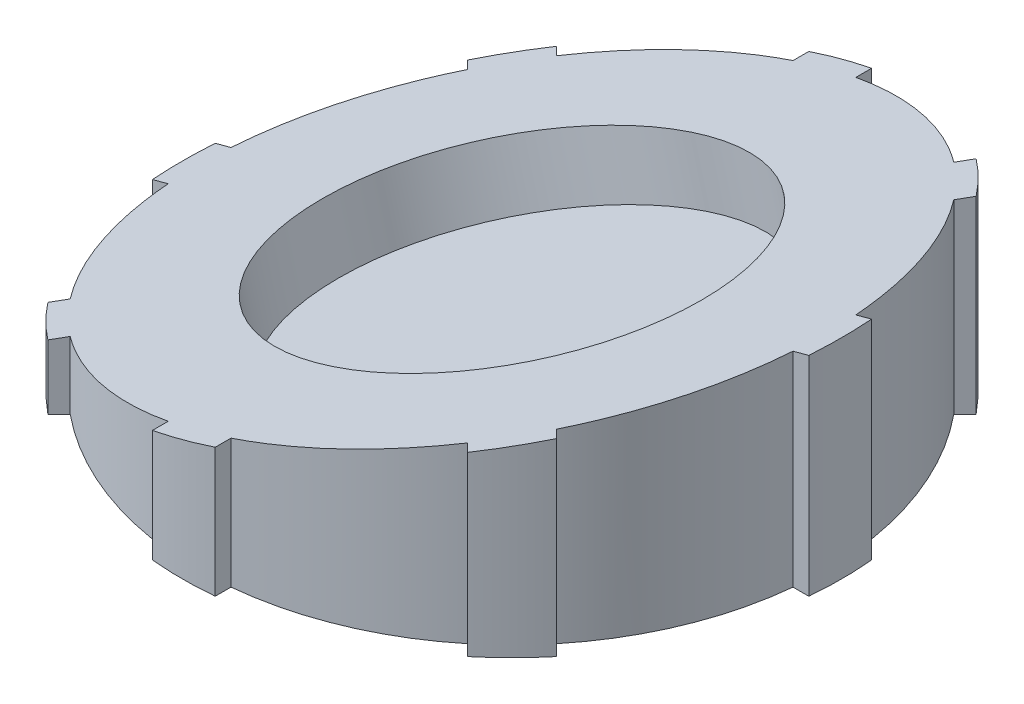
ISO-10303-21;
HEADER;
FILE_DESCRIPTION(('STEP AP214'),'2;1');
FILE_NAME('part.step','',(''),(''),'','','');
FILE_SCHEMA(('AUTOMOTIVE_DESIGN { 1 0 10303 214 1 1 1 1 }'));
ENDSEC;
DATA;
#1=APPLICATION_CONTEXT('core data for automotive mechanical design processes');
#2=APPLICATION_PROTOCOL_DEFINITION('international standard','automotive_design',2000,#1);
#3=PRODUCT_CONTEXT('',#1,'mechanical');
#4=PRODUCT('Part','Part','',(#3));
#5=PRODUCT_RELATED_PRODUCT_CATEGORY('part','',(#4));
#6=PRODUCT_DEFINITION_FORMATION('','',#4);
#7=PRODUCT_DEFINITION_CONTEXT('part definition',#1,'design');
#8=PRODUCT_DEFINITION('design','',#6,#7);
#9=PRODUCT_DEFINITION_SHAPE('','',#8);
#10=(LENGTH_UNIT() NAMED_UNIT(*) SI_UNIT(.MILLI.,.METRE.));
#11=(NAMED_UNIT(*) PLANE_ANGLE_UNIT() SI_UNIT($,.RADIAN.));
#12=(NAMED_UNIT(*) SI_UNIT($,.STERADIAN.) SOLID_ANGLE_UNIT());
#13=UNCERTAINTY_MEASURE_WITH_UNIT(LENGTH_MEASURE(1.E-05),#10,'distance_accuracy_value','');
#14=(GEOMETRIC_REPRESENTATION_CONTEXT(3) GLOBAL_UNCERTAINTY_ASSIGNED_CONTEXT((#13)) GLOBAL_UNIT_ASSIGNED_CONTEXT((#10,
#11,#12)) REPRESENTATION_CONTEXT('',''));
#15=CARTESIAN_POINT('',(0.,0.,0.));
#16=DIRECTION('',(0.,0.,1.));
#17=DIRECTION('',(1.,0.,0.));
#18=AXIS2_PLACEMENT_3D('',#15,#16,#17);
#19=CARTESIAN_POINT('',(0.,20.,0.));
#20=DIRECTION('',(0.,-1.,0.));
#21=DIRECTION('',(0.,0.,-1.));
#22=AXIS2_PLACEMENT_3D('',#19,#20,#21);
#23=CYLINDRICAL_SURFACE('',#22,20.);
#24=DIRECTION('',(0.,-1.,0.));
#25=VECTOR('',#24,1.);
#26=CARTESIAN_POINT('',(15.4854608418434,20.,-12.6570337170972));
#27=LINE('',#26,#25);
#28=CARTESIAN_POINT('',(15.4854608418434,0.,-12.6570337170972));
#29=VERTEX_POINT('',#28);
#30=CARTESIAN_POINT('',(15.4854608418434,11.8348990246691,-12.6570337170972));
#31=VERTEX_POINT('',#30);
#32=EDGE_CURVE('E321',#29,#31,#27,.F.);
#33=ORIENTED_EDGE('',*,*,#32,.T.);
#34=CARTESIAN_POINT('',(0.,7.68558229767337,0.));
#35=DIRECTION('',(0.258819045102522,-0.965925826289068,0.));
#36=DIRECTION('',(-0.965925826289068,-0.258819045102522,0.));
#37=AXIS2_PLACEMENT_3D('',#34,#35,#36);
#38=ELLIPSE('',#37,20.7055236082017,20.);
#39=CARTESIAN_POINT('',(19.8997487421324,13.01770390271,-1.99999999999993));
#40=VERTEX_POINT('',#39);
#41=EDGE_CURVE('E586',#31,#40,#38,.T.);
#42=ORIENTED_EDGE('',*,*,#41,.T.);
#43=DIRECTION('',(0.,-1.,0.));
#44=VECTOR('',#43,1.);
#45=CARTESIAN_POINT('',(19.8997487421324,20.,-1.99999999999993));
#46=LINE('',#45,#44);
#47=CARTESIAN_POINT('',(19.8997487421324,0.,-1.99999999999993));
#48=VERTEX_POINT('',#47);
#49=EDGE_CURVE('E63',#40,#48,#46,.T.);
#50=ORIENTED_EDGE('',*,*,#49,.T.);
#51=CARTESIAN_POINT('',(0.,0.,0.));
#52=DIRECTION('',(0.,1.,0.));
#53=DIRECTION('',(0.,0.,1.));
#54=AXIS2_PLACEMENT_3D('',#51,#52,#53);
#55=CIRCLE('',#54,20.);
#56=EDGE_CURVE('E382',#48,#29,#55,.T.);
#57=ORIENTED_EDGE('',*,*,#56,.T.);
#58=EDGE_LOOP('',(#33,#42,#50,#57));
#59=FACE_BOUND('',#58,.T.);
#60=ADVANCED_FACE('F40',(#59),#23,.T.);
#61=DIRECTION('',(0.,-1.,0.));
#62=VECTOR('',#61,1.);
#63=CARTESIAN_POINT('',(19.8997487421324,20.,2.00000000000007));
#64=LINE('',#63,#62);
#65=CARTESIAN_POINT('',(19.8997487421324,0.,2.00000000000007));
#66=VERTEX_POINT('',#65);
#67=CARTESIAN_POINT('',(19.8997487421324,13.01770390271,2.00000000000007));
#68=VERTEX_POINT('',#67);
#69=EDGE_CURVE('E294',#66,#68,#64,.F.);
#70=ORIENTED_EDGE('',*,*,#69,.T.);
#71=CARTESIAN_POINT('',(0.,7.68558229767337,0.));
#72=DIRECTION('',(0.258819045102522,-0.965925826289068,0.));
#73=DIRECTION('',(-0.965925826289068,-0.258819045102522,0.));
#74=AXIS2_PLACEMENT_3D('',#71,#72,#73);
#75=ELLIPSE('',#74,20.7055236082017,20.);
#76=CARTESIAN_POINT('',(15.4854608418433,11.8348990246691,12.6570337170973));
#77=VERTEX_POINT('',#76);
#78=EDGE_CURVE('E560',#68,#77,#75,.T.);
#79=ORIENTED_EDGE('',*,*,#78,.T.);
#80=DIRECTION('',(0.,-1.,0.));
#81=VECTOR('',#80,1.);
#82=CARTESIAN_POINT('',(15.4854608418433,20.,12.6570337170973));
#83=LINE('',#82,#81);
#84=CARTESIAN_POINT('',(15.4854608418433,0.,12.6570337170973));
#85=VERTEX_POINT('',#84);
#86=EDGE_CURVE('E284',#77,#85,#83,.T.);
#87=ORIENTED_EDGE('',*,*,#86,.T.);
#88=EDGE_CURVE('E375',#85,#66,#55,.T.);
#89=ORIENTED_EDGE('',*,*,#88,.T.);
#90=EDGE_LOOP('',(#70,#79,#87,#89));
#91=FACE_BOUND('',#90,.T.);
#92=ADVANCED_FACE('F618',(#91),#23,.T.);
#93=DIRECTION('',(0.,-1.,0.));
#94=VECTOR('',#93,1.);
#95=CARTESIAN_POINT('',(12.6570337170971,20.,15.4854608418434));
#96=LINE('',#95,#94);
#97=CARTESIAN_POINT('',(12.6570337170971,0.,15.4854608418434));
#98=VERTEX_POINT('',#97);
#99=CARTESIAN_POINT('',(12.6570337170971,11.077024260743,15.4854608418434));
#100=VERTEX_POINT('',#99);
#101=EDGE_CURVE('E287',#98,#100,#96,.F.);
#102=ORIENTED_EDGE('',*,*,#101,.T.);
#103=CARTESIAN_POINT('',(0.,7.68558229767337,0.));
#104=DIRECTION('',(0.258819045102522,-0.965925826289068,0.));
#105=DIRECTION('',(-0.965925826289068,-0.258819045102522,0.));
#106=AXIS2_PLACEMENT_3D('',#103,#104,#105);
#107=ELLIPSE('',#106,20.7055236082017,20.);
#108=CARTESIAN_POINT('',(2.,8.22148068253561,19.8997487421324));
#109=VERTEX_POINT('',#108);
#110=EDGE_CURVE('E534',#100,#109,#107,.T.);
#111=ORIENTED_EDGE('',*,*,#110,.T.);
#112=DIRECTION('',(0.,-1.,0.));
#113=VECTOR('',#112,1.);
#114=CARTESIAN_POINT('',(2.,20.,19.8997487421324));
#115=LINE('',#114,#113);
#116=CARTESIAN_POINT('',(2.,0.,19.8997487421324));
#117=VERTEX_POINT('',#116);
#118=EDGE_CURVE('E370',#109,#117,#115,.T.);
#119=ORIENTED_EDGE('',*,*,#118,.T.);
#120=EDGE_CURVE('E49',#117,#98,#55,.T.);
#121=ORIENTED_EDGE('',*,*,#120,.T.);
#122=EDGE_LOOP('',(#102,#111,#119,#121));
#123=FACE_BOUND('',#122,.T.);
#124=ADVANCED_FACE('F622',(#123),#23,.T.);
#125=DIRECTION('',(0.,-1.,0.));
#126=VECTOR('',#125,1.);
#127=CARTESIAN_POINT('',(-15.4854608418434,20.,12.6570337170972));
#128=LINE('',#127,#126);
#129=CARTESIAN_POINT('',(-15.4854608418434,0.,12.6570337170972));
#130=VERTEX_POINT('',#129);
#131=CARTESIAN_POINT('',(-15.4854608418434,3.53626557067764,12.6570337170972));
#132=VERTEX_POINT('',#131);
#133=EDGE_CURVE('E317',#130,#132,#128,.F.);
#134=ORIENTED_EDGE('',*,*,#133,.T.);
#135=CARTESIAN_POINT('',(0.,7.68558229767337,0.));
#136=DIRECTION('',(0.258819045102522,-0.965925826289068,0.));
#137=DIRECTION('',(-0.965925826289068,-0.258819045102522,0.));
#138=AXIS2_PLACEMENT_3D('',#135,#136,#137);
#139=ELLIPSE('',#138,20.7055236082017,20.);
#140=CARTESIAN_POINT('',(-19.8997487421324,2.35346069263672,1.99999999999993));
#141=VERTEX_POINT('',#140);
#142=EDGE_CURVE('E510',#132,#141,#139,.T.);
#143=ORIENTED_EDGE('',*,*,#142,.T.);
#144=DIRECTION('',(0.,-1.,0.));
#145=VECTOR('',#144,1.);
#146=CARTESIAN_POINT('',(-19.8997487421324,20.,1.99999999999993));
#147=LINE('',#146,#145);
#148=CARTESIAN_POINT('',(-19.8997487421324,0.,1.99999999999993));
#149=VERTEX_POINT('',#148);
#150=EDGE_CURVE('E298',#141,#149,#147,.T.);
#151=ORIENTED_EDGE('',*,*,#150,.T.);
#152=EDGE_CURVE('E391',#149,#130,#55,.T.);
#153=ORIENTED_EDGE('',*,*,#152,.T.);
#154=EDGE_LOOP('',(#134,#143,#151,#153));
#155=FACE_BOUND('',#154,.T.);
#156=ADVANCED_FACE('F913',(#155),#23,.T.);
#157=DIRECTION('',(0.,-1.,0.));
#158=VECTOR('',#157,1.);
#159=CARTESIAN_POINT('',(-19.8997487421324,20.,-2.00000000000007));
#160=LINE('',#159,#158);
#161=CARTESIAN_POINT('',(-19.8997487421324,0.,-2.00000000000007));
#162=VERTEX_POINT('',#161);
#163=CARTESIAN_POINT('',(-19.8997487421324,2.35346069263672,-2.00000000000007));
#164=VERTEX_POINT('',#163);
#165=EDGE_CURVE('E308',#162,#164,#160,.F.);
#166=ORIENTED_EDGE('',*,*,#165,.T.);
#167=CARTESIAN_POINT('',(0.,7.68558229767337,0.));
#168=DIRECTION('',(0.258819045102522,-0.965925826289068,0.));
#169=DIRECTION('',(-0.965925826289068,-0.258819045102522,0.));
#170=AXIS2_PLACEMENT_3D('',#167,#168,#169);
#171=ELLIPSE('',#170,20.7055236082017,20.);
#172=CARTESIAN_POINT('',(-15.4854608418433,3.53626557067766,-12.6570337170973));
#173=VERTEX_POINT('',#172);
#174=EDGE_CURVE('E538',#164,#173,#171,.T.);
#175=ORIENTED_EDGE('',*,*,#174,.T.);
#176=DIRECTION('',(0.,-1.,0.));
#177=VECTOR('',#176,1.);
#178=CARTESIAN_POINT('',(-15.4854608418433,20.,-12.6570337170973));
#179=LINE('',#178,#177);
#180=CARTESIAN_POINT('',(-15.4854608418433,0.,-12.6570337170973));
#181=VERTEX_POINT('',#180);
#182=EDGE_CURVE('E305',#173,#181,#179,.T.);
#183=ORIENTED_EDGE('',*,*,#182,.T.);
#184=EDGE_CURVE('E386',#181,#162,#55,.T.);
#185=ORIENTED_EDGE('',*,*,#184,.T.);
#186=EDGE_LOOP('',(#166,#175,#183,#185));
#187=FACE_BOUND('',#186,.T.);
#188=ADVANCED_FACE('F636',(#187),#23,.T.);
#189=DIRECTION('',(0.,-1.,0.));
#190=VECTOR('',#189,1.);
#191=CARTESIAN_POINT('',(-12.6570337170971,20.,-15.4854608418434));
#192=LINE('',#191,#190);
#193=CARTESIAN_POINT('',(-12.6570337170971,0.,-15.4854608418434));
#194=VERTEX_POINT('',#193);
#195=CARTESIAN_POINT('',(-12.6570337170971,4.29414033460369,-15.4854608418434));
#196=VERTEX_POINT('',#195);
#197=EDGE_CURVE('E301',#194,#196,#192,.F.);
#198=ORIENTED_EDGE('',*,*,#197,.T.);
#199=CARTESIAN_POINT('',(0.,7.68558229767337,0.));
#200=DIRECTION('',(0.258819045102522,-0.965925826289068,0.));
#201=DIRECTION('',(-0.965925826289068,-0.258819045102522,0.));
#202=AXIS2_PLACEMENT_3D('',#199,#200,#201);
#203=ELLIPSE('',#202,20.7055236082017,20.);
#204=CARTESIAN_POINT('',(-2.,7.14968391281112,-19.8997487421324));
#205=VERTEX_POINT('',#204);
#206=EDGE_CURVE('E564',#196,#205,#203,.T.);
#207=ORIENTED_EDGE('',*,*,#206,.T.);
#208=DIRECTION('',(0.,-1.,0.));
#209=VECTOR('',#208,1.);
#210=CARTESIAN_POINT('',(-2.,20.,-19.8997487421324));
#211=LINE('',#210,#209);
#212=CARTESIAN_POINT('',(-2.,0.,-19.8997487421324));
#213=VERTEX_POINT('',#212);
#214=EDGE_CURVE('E363',#205,#213,#211,.T.);
#215=ORIENTED_EDGE('',*,*,#214,.T.);
#216=EDGE_CURVE('E377',#213,#194,#55,.T.);
#217=ORIENTED_EDGE('',*,*,#216,.T.);
#218=EDGE_LOOP('',(#198,#207,#215,#217));
#219=FACE_BOUND('',#218,.T.);
#220=ADVANCED_FACE('F631',(#219),#23,.T.);
#221=DIRECTION('',(0.,-1.,0.));
#222=VECTOR('',#221,1.);
#223=CARTESIAN_POINT('',(2.,20.,-19.8997487421324));
#224=LINE('',#223,#222);
#225=CARTESIAN_POINT('',(2.,0.,-19.8997487421324));
#226=VERTEX_POINT('',#225);
#227=CARTESIAN_POINT('',(2.,8.22148068253561,-19.8997487421324));
#228=VERTEX_POINT('',#227);
#229=EDGE_CURVE('E366',#226,#228,#224,.F.);
#230=ORIENTED_EDGE('',*,*,#229,.T.);
#231=CARTESIAN_POINT('',(0.,7.68558229767337,0.));
#232=DIRECTION('',(0.258819045102522,-0.965925826289068,0.));
#233=DIRECTION('',(-0.965925826289068,-0.258819045102522,0.));
#234=AXIS2_PLACEMENT_3D('',#231,#232,#233);
#235=ELLIPSE('',#234,20.7055236082017,20.);
#236=CARTESIAN_POINT('',(12.6570337170972,11.0770242607431,-15.4854608418434));
#237=VERTEX_POINT('',#236);
#238=EDGE_CURVE('E589',#228,#237,#235,.T.);
#239=ORIENTED_EDGE('',*,*,#238,.T.);
#240=DIRECTION('',(0.,-1.,0.));
#241=VECTOR('',#240,1.);
#242=CARTESIAN_POINT('',(12.6570337170972,20.,-15.4854608418434));
#243=LINE('',#242,#241);
#244=CARTESIAN_POINT('',(12.6570337170972,0.,-15.4854608418434));
#245=VERTEX_POINT('',#244);
#246=EDGE_CURVE('E262',#237,#245,#243,.T.);
#247=ORIENTED_EDGE('',*,*,#246,.T.);
#248=EDGE_CURVE('E376',#245,#226,#55,.T.);
#249=ORIENTED_EDGE('',*,*,#248,.T.);
#250=EDGE_LOOP('',(#230,#239,#247,#249));
#251=FACE_BOUND('',#250,.T.);
#252=ADVANCED_FACE('F625',(#251),#23,.T.);
#253=DIRECTION('',(0.,-1.,0.));
#254=VECTOR('',#253,1.);
#255=CARTESIAN_POINT('',(-2.,20.,19.8997487421324));
#256=LINE('',#255,#254);
#257=CARTESIAN_POINT('',(-2.,0.,19.8997487421324));
#258=VERTEX_POINT('',#257);
#259=CARTESIAN_POINT('',(-2.,7.14968391281112,19.8997487421324));
#260=VERTEX_POINT('',#259);
#261=EDGE_CURVE('E348',#258,#260,#256,.F.);
#262=ORIENTED_EDGE('',*,*,#261,.T.);
#263=CARTESIAN_POINT('',(0.,7.68558229767337,0.));
#264=DIRECTION('',(0.258819045102522,-0.965925826289068,0.));
#265=DIRECTION('',(-0.965925826289068,-0.258819045102522,0.));
#266=AXIS2_PLACEMENT_3D('',#263,#264,#265);
#267=ELLIPSE('',#266,20.7055236082017,20.);
#268=CARTESIAN_POINT('',(-12.6570337170972,4.29414033460366,15.4854608418434));
#269=VERTEX_POINT('',#268);
#270=EDGE_CURVE('E514',#260,#269,#267,.T.);
#271=ORIENTED_EDGE('',*,*,#270,.T.);
#272=DIRECTION('',(0.,-1.,0.));
#273=VECTOR('',#272,1.);
#274=CARTESIAN_POINT('',(-12.6570337170972,20.,15.4854608418434));
#275=LINE('',#274,#273);
#276=CARTESIAN_POINT('',(-12.6570337170972,0.,15.4854608418434));
#277=VERTEX_POINT('',#276);
#278=EDGE_CURVE('E314',#269,#277,#275,.T.);
#279=ORIENTED_EDGE('',*,*,#278,.T.);
#280=EDGE_CURVE('E372',#277,#258,#55,.T.);
#281=ORIENTED_EDGE('',*,*,#280,.T.);
#282=EDGE_LOOP('',(#262,#271,#279,#281));
#283=FACE_BOUND('',#282,.T.);
#284=ADVANCED_FACE('F42',(#283),#23,.T.);
#285=CARTESIAN_POINT('',(0.,0.,0.));
#286=DIRECTION('',(0.,1.,0.));
#287=DIRECTION('',(0.,0.,1.));
#288=AXIS2_PLACEMENT_3D('',#285,#286,#287);
#289=PLANE('',#288);
#290=ORIENTED_EDGE('',*,*,#248,.F.);
#291=DIRECTION('',(-0.707106781186549,0.,0.707106781186546));
#292=VECTOR('',#291,1.);
#293=CARTESIAN_POINT('',(-16.1959590614676,0.,13.3675319367214));
#294=LINE('',#293,#292);
#295=CARTESIAN_POINT('',(13.3675319367214,0.,-16.1959590614676));
#296=VERTEX_POINT('',#295);
#297=EDGE_CURVE('E428',#296,#245,#294,.T.);
#298=ORIENTED_EDGE('',*,*,#297,.F.);
#299=CARTESIAN_POINT('',(0.,0.,0.));
#300=DIRECTION('',(0.,1.,0.));
#301=DIRECTION('',(-0.707106781186549,0.,0.707106781186546));
#302=AXIS2_PLACEMENT_3D('',#299,#300,#301);
#303=CIRCLE('',#302,21.);
#304=CARTESIAN_POINT('',(16.1959590614676,0.,-13.3675319367214));
#305=VERTEX_POINT('',#304);
#306=EDGE_CURVE('E269',#305,#296,#303,.T.);
#307=ORIENTED_EDGE('',*,*,#306,.F.);
#308=DIRECTION('',(0.707106781186549,0.,-0.707106781186546));
#309=VECTOR('',#308,1.);
#310=CARTESIAN_POINT('',(-13.3675319367214,0.,16.1959590614676));
#311=LINE('',#310,#309);
#312=EDGE_CURVE('E280',#29,#305,#311,.T.);
#313=ORIENTED_EDGE('',*,*,#312,.F.);
#314=ORIENTED_EDGE('',*,*,#56,.F.);
#315=DIRECTION('',(-1.,0.,0.));
#316=VECTOR('',#315,1.);
#317=CARTESIAN_POINT('',(-20.9045449603669,0.,-2.00000000000007));
#318=LINE('',#317,#316);
#319=CARTESIAN_POINT('',(20.9045449603669,0.,-1.99999999999993));
#320=VERTEX_POINT('',#319);
#321=EDGE_CURVE('E459',#320,#48,#318,.T.);
#322=ORIENTED_EDGE('',*,*,#321,.F.);
#323=CARTESIAN_POINT('',(0.,0.,0.));
#324=DIRECTION('',(0.,1.,0.));
#325=DIRECTION('',(-1.,0.,0.));
#326=AXIS2_PLACEMENT_3D('',#323,#324,#325);
#327=CIRCLE('',#326,21.);
#328=CARTESIAN_POINT('',(20.9045449603669,0.,2.00000000000007));
#329=VERTEX_POINT('',#328);
#330=EDGE_CURVE('E463',#329,#320,#327,.T.);
#331=ORIENTED_EDGE('',*,*,#330,.F.);
#332=DIRECTION('',(1.,0.,0.));
#333=VECTOR('',#332,1.);
#334=CARTESIAN_POINT('',(-20.9045449603669,0.,1.99999999999993));
#335=LINE('',#334,#333);
#336=EDGE_CURVE('E454',#66,#329,#335,.T.);
#337=ORIENTED_EDGE('',*,*,#336,.F.);
#338=ORIENTED_EDGE('',*,*,#88,.F.);
#339=DIRECTION('',(-0.707106781186544,0.,-0.707106781186551));
#340=VECTOR('',#339,1.);
#341=CARTESIAN_POINT('',(-13.3675319367213,0.,-16.1959590614676));
#342=LINE('',#341,#340);
#343=CARTESIAN_POINT('',(16.1959590614675,0.,13.3675319367215));
#344=VERTEX_POINT('',#343);
#345=EDGE_CURVE('E492',#344,#85,#342,.T.);
#346=ORIENTED_EDGE('',*,*,#345,.F.);
#347=CARTESIAN_POINT('',(0.,0.,0.));
#348=DIRECTION('',(0.,1.,0.));
#349=DIRECTION('',(-0.707106781186544,0.,-0.707106781186551));
#350=AXIS2_PLACEMENT_3D('',#347,#348,#349);
#351=CIRCLE('',#350,21.);
#352=CARTESIAN_POINT('',(13.3675319367213,0.,16.1959590614676));
#353=VERTEX_POINT('',#352);
#354=EDGE_CURVE('E497',#353,#344,#351,.T.);
#355=ORIENTED_EDGE('',*,*,#354,.F.);
#356=DIRECTION('',(0.707106781186544,0.,0.707106781186551));
#357=VECTOR('',#356,1.);
#358=CARTESIAN_POINT('',(-16.1959590614675,0.,-13.3675319367215));
#359=LINE('',#358,#357);
#360=EDGE_CURVE('E487',#98,#353,#359,.T.);
#361=ORIENTED_EDGE('',*,*,#360,.F.);
#362=ORIENTED_EDGE('',*,*,#120,.F.);
#363=DIRECTION('',(0.,0.,-1.));
#364=VECTOR('',#363,1.);
#365=CARTESIAN_POINT('',(2.,0.,20.9045449603669));
#366=LINE('',#365,#364);
#367=CARTESIAN_POINT('',(2.00000000000001,0.,20.9045449603669));
#368=VERTEX_POINT('',#367);
#369=EDGE_CURVE('E339',#368,#117,#366,.T.);
#370=ORIENTED_EDGE('',*,*,#369,.F.);
#371=CARTESIAN_POINT('',(0.,0.,0.));
#372=DIRECTION('',(0.,1.,0.));
#373=DIRECTION('',(0.,0.,1.));
#374=AXIS2_PLACEMENT_3D('',#371,#372,#373);
#375=CIRCLE('',#374,21.);
#376=CARTESIAN_POINT('',(-2.,0.,20.9045449603669));
#377=VERTEX_POINT('',#376);
#378=EDGE_CURVE('E334',#377,#368,#375,.T.);
#379=ORIENTED_EDGE('',*,*,#378,.F.);
#380=DIRECTION('',(0.,0.,1.));
#381=VECTOR('',#380,1.);
#382=CARTESIAN_POINT('',(-2.,0.,20.9045449603669));
#383=LINE('',#382,#381);
#384=EDGE_CURVE('E329',#258,#377,#383,.T.);
#385=ORIENTED_EDGE('',*,*,#384,.F.);
#386=ORIENTED_EDGE('',*,*,#280,.F.);
#387=CARTESIAN_POINT('',(-13.3675319367214,0.,16.1959590614676));
#388=VERTEX_POINT('',#387);
#389=EDGE_CURVE('E272',#388,#277,#311,.T.);
#390=ORIENTED_EDGE('',*,*,#389,.F.);
#391=CARTESIAN_POINT('',(0.,0.,0.));
#392=DIRECTION('',(0.,1.,0.));
#393=DIRECTION('',(-0.707106781186549,0.,0.707106781186546));
#394=AXIS2_PLACEMENT_3D('',#391,#392,#393);
#395=CIRCLE('',#394,21.);
#396=CARTESIAN_POINT('',(-16.1959590614676,0.,13.3675319367214));
#397=VERTEX_POINT('',#396);
#398=EDGE_CURVE('E425',#397,#388,#395,.T.);
#399=ORIENTED_EDGE('',*,*,#398,.F.);
#400=EDGE_CURVE('E431',#130,#397,#294,.T.);
#401=ORIENTED_EDGE('',*,*,#400,.F.);
#402=ORIENTED_EDGE('',*,*,#152,.F.);
#403=CARTESIAN_POINT('',(-20.9045449603669,0.,1.99999999999993));
#404=VERTEX_POINT('',#403);
#405=EDGE_CURVE('E440',#404,#149,#335,.T.);
#406=ORIENTED_EDGE('',*,*,#405,.F.);
#407=CARTESIAN_POINT('',(0.,0.,0.));
#408=DIRECTION('',(0.,1.,0.));
#409=DIRECTION('',(-1.,0.,0.));
#410=AXIS2_PLACEMENT_3D('',#407,#408,#409);
#411=CIRCLE('',#410,21.);
#412=CARTESIAN_POINT('',(-20.9045449603669,0.,-2.00000000000007));
#413=VERTEX_POINT('',#412);
#414=EDGE_CURVE('E455',#413,#404,#411,.T.);
#415=ORIENTED_EDGE('',*,*,#414,.F.);
#416=EDGE_CURVE('E462',#162,#413,#318,.T.);
#417=ORIENTED_EDGE('',*,*,#416,.F.);
#418=ORIENTED_EDGE('',*,*,#184,.F.);
#419=CARTESIAN_POINT('',(-16.1959590614675,0.,-13.3675319367215));
#420=VERTEX_POINT('',#419);
#421=EDGE_CURVE('E473',#420,#181,#359,.T.);
#422=ORIENTED_EDGE('',*,*,#421,.F.);
#423=CARTESIAN_POINT('',(0.,0.,0.));
#424=DIRECTION('',(0.,1.,0.));
#425=DIRECTION('',(-0.707106781186544,0.,-0.707106781186551));
#426=AXIS2_PLACEMENT_3D('',#423,#424,#425);
#427=CIRCLE('',#426,21.);
#428=CARTESIAN_POINT('',(-13.3675319367213,0.,-16.1959590614676));
#429=VERTEX_POINT('',#428);
#430=EDGE_CURVE('E488',#429,#420,#427,.T.);
#431=ORIENTED_EDGE('',*,*,#430,.F.);
#432=EDGE_CURVE('E496',#194,#429,#342,.T.);
#433=ORIENTED_EDGE('',*,*,#432,.F.);
#434=ORIENTED_EDGE('',*,*,#216,.F.);
#435=CARTESIAN_POINT('',(-2.,0.,-20.9045449603669));
#436=VERTEX_POINT('',#435);
#437=EDGE_CURVE('E330',#436,#213,#383,.T.);
#438=ORIENTED_EDGE('',*,*,#437,.F.);
#439=CARTESIAN_POINT('',(0.,0.,0.));
#440=DIRECTION('',(0.,1.,0.));
#441=DIRECTION('',(0.,0.,1.));
#442=AXIS2_PLACEMENT_3D('',#439,#440,#441);
#443=CIRCLE('',#442,21.);
#444=CARTESIAN_POINT('',(2.,0.,-20.9045449603669));
#445=VERTEX_POINT('',#444);
#446=EDGE_CURVE('E325',#445,#436,#443,.T.);
#447=ORIENTED_EDGE('',*,*,#446,.F.);
#448=EDGE_CURVE('E338',#226,#445,#366,.T.);
#449=ORIENTED_EDGE('',*,*,#448,.F.);
#450=EDGE_LOOP('',(#290,#298,#307,#313,#314,#322,#331,#337,#338,#346,#355,#361,#362,#370,#379,
#385,#386,#390,#399,#401,#402,#406,#415,#417,#418,#422,#431,#433,#434,#438,#447,#449));
#451=FACE_BOUND('',#450,.T.);
#452=ADVANCED_FACE('F414',(#451),#289,.F.);
#453=CARTESIAN_POINT('',(0.,0.,0.));
#454=DIRECTION('',(0.,1.,0.));
#455=DIRECTION('',(0.,0.,1.));
#456=AXIS2_PLACEMENT_3D('',#453,#454,#455);
#457=CYLINDRICAL_SURFACE('',#456,21.);
#458=CARTESIAN_POINT('',(0.,7.68558229767337,0.));
#459=DIRECTION('',(0.258819045102522,-0.965925826289068,0.));
#460=DIRECTION('',(0.965925826289068,0.258819045102522,0.));
#461=AXIS2_PLACEMENT_3D('',#458,#459,#460);
#462=ELLIPSE('',#461,21.7407997886117,21.);
#463=CARTESIAN_POINT('',(-2.,7.14968391281112,20.9045449603669));
#464=VERTEX_POINT('',#463);
#465=CARTESIAN_POINT('',(2.,8.22148068253561,20.9045449603669));
#466=VERTEX_POINT('',#465);
#467=EDGE_CURVE('E522',#464,#466,#462,.F.);
#468=ORIENTED_EDGE('',*,*,#467,.F.);
#469=DIRECTION('',(0.,1.,0.));
#470=VECTOR('',#469,1.);
#471=CARTESIAN_POINT('',(-2.,0.,20.9045449603669));
#472=LINE('',#471,#470);
#473=EDGE_CURVE('E353',#377,#464,#472,.T.);
#474=ORIENTED_EDGE('',*,*,#473,.F.);
#475=ORIENTED_EDGE('',*,*,#378,.T.);
#476=DIRECTION('',(0.,1.,0.));
#477=VECTOR('',#476,1.);
#478=CARTESIAN_POINT('',(2.00000000000001,0.,20.9045449603669));
#479=LINE('',#478,#477);
#480=EDGE_CURVE('E349',#368,#466,#479,.T.);
#481=ORIENTED_EDGE('',*,*,#480,.T.);
#482=EDGE_LOOP('',(#468,#474,#475,#481));
#483=FACE_BOUND('',#482,.T.);
#484=ADVANCED_FACE('F630',(#483),#457,.T.);
#485=CARTESIAN_POINT('',(-2.,0.,20.9045449603669));
#486=DIRECTION('',(-1.,0.,0.));
#487=DIRECTION('',(0.,0.,1.));
#488=AXIS2_PLACEMENT_3D('',#485,#486,#487);
#489=PLANE('',#488);
#490=DIRECTION('',(0.,0.,1.));
#491=VECTOR('',#490,1.);
#492=CARTESIAN_POINT('',(-2.,7.14968391281112,20.9045449603669));
#493=LINE('',#492,#491);
#494=EDGE_CURVE('E411',#260,#464,#493,.T.);
#495=ORIENTED_EDGE('',*,*,#494,.F.);
#496=ORIENTED_EDGE('',*,*,#261,.F.);
#497=ORIENTED_EDGE('',*,*,#384,.T.);
#498=ORIENTED_EDGE('',*,*,#473,.T.);
#499=EDGE_LOOP('',(#495,#496,#497,#498));
#500=FACE_BOUND('',#499,.T.);
#501=ADVANCED_FACE('F409',(#500),#489,.T.);
#502=CARTESIAN_POINT('',(2.,0.,20.9045449603669));
#503=DIRECTION('',(1.,0.,0.));
#504=DIRECTION('',(0.,0.,-1.));
#505=AXIS2_PLACEMENT_3D('',#502,#503,#504);
#506=PLANE('',#505);
#507=DIRECTION('',(0.,0.,-1.));
#508=VECTOR('',#507,1.);
#509=CARTESIAN_POINT('',(2.,8.22148068253561,20.9045449603669));
#510=LINE('',#509,#508);
#511=EDGE_CURVE('E525',#466,#109,#510,.T.);
#512=ORIENTED_EDGE('',*,*,#511,.F.);
#513=ORIENTED_EDGE('',*,*,#480,.F.);
#514=ORIENTED_EDGE('',*,*,#369,.T.);
#515=ORIENTED_EDGE('',*,*,#118,.F.);
#516=EDGE_LOOP('',(#512,#513,#514,#515));
#517=FACE_BOUND('',#516,.T.);
#518=ADVANCED_FACE('F732',(#517),#506,.T.);
#519=DIRECTION('',(0.,0.,-1.));
#520=VECTOR('',#519,1.);
#521=CARTESIAN_POINT('',(2.,8.22148068253561,20.9045449603669));
#522=LINE('',#521,#520);
#523=CARTESIAN_POINT('',(2.,8.22148068253561,-20.9045449603669));
#524=VERTEX_POINT('',#523);
#525=EDGE_CURVE('E577',#228,#524,#522,.T.);
#526=ORIENTED_EDGE('',*,*,#525,.F.);
#527=ORIENTED_EDGE('',*,*,#229,.F.);
#528=ORIENTED_EDGE('',*,*,#448,.T.);
#529=DIRECTION('',(0.,1.,0.));
#530=VECTOR('',#529,1.);
#531=CARTESIAN_POINT('',(2.,0.,-20.9045449603669));
#532=LINE('',#531,#530);
#533=EDGE_CURVE('E344',#445,#524,#532,.T.);
#534=ORIENTED_EDGE('',*,*,#533,.T.);
#535=EDGE_LOOP('',(#526,#527,#528,#534));
#536=FACE_BOUND('',#535,.T.);
#537=ADVANCED_FACE('F641',(#536),#506,.T.);
#538=DIRECTION('',(0.,0.,1.));
#539=VECTOR('',#538,1.);
#540=CARTESIAN_POINT('',(-2.,7.14968391281112,20.9045449603669));
#541=LINE('',#540,#539);
#542=CARTESIAN_POINT('',(-2.,7.14968391281112,-20.9045449603669));
#543=VERTEX_POINT('',#542);
#544=EDGE_CURVE('E568',#543,#205,#541,.T.);
#545=ORIENTED_EDGE('',*,*,#544,.F.);
#546=DIRECTION('',(0.,1.,0.));
#547=VECTOR('',#546,1.);
#548=CARTESIAN_POINT('',(-2.,0.,-20.9045449603669));
#549=LINE('',#548,#547);
#550=EDGE_CURVE('E343',#436,#543,#549,.T.);
#551=ORIENTED_EDGE('',*,*,#550,.F.);
#552=ORIENTED_EDGE('',*,*,#437,.T.);
#553=ORIENTED_EDGE('',*,*,#214,.F.);
#554=EDGE_LOOP('',(#545,#551,#552,#553));
#555=FACE_BOUND('',#554,.T.);
#556=ADVANCED_FACE('F652',(#555),#489,.T.);
#557=CARTESIAN_POINT('',(0.,0.,0.));
#558=DIRECTION('',(0.,1.,0.));
#559=DIRECTION('',(0.,0.,1.));
#560=AXIS2_PLACEMENT_3D('',#557,#558,#559);
#561=CYLINDRICAL_SURFACE('',#560,21.);
#562=CARTESIAN_POINT('',(0.,7.68558229767337,0.));
#563=DIRECTION('',(0.258819045102522,-0.965925826289068,0.));
#564=DIRECTION('',(0.965925826289068,0.258819045102522,0.));
#565=AXIS2_PLACEMENT_3D('',#562,#563,#564);
#566=ELLIPSE('',#565,21.7407997886117,21.);
#567=EDGE_CURVE('E571',#524,#543,#566,.F.);
#568=ORIENTED_EDGE('',*,*,#567,.F.);
#569=ORIENTED_EDGE('',*,*,#533,.F.);
#570=ORIENTED_EDGE('',*,*,#446,.T.);
#571=ORIENTED_EDGE('',*,*,#550,.T.);
#572=EDGE_LOOP('',(#568,#569,#570,#571));
#573=FACE_BOUND('',#572,.T.);
#574=ADVANCED_FACE('F648',(#573),#561,.T.);
#575=CARTESIAN_POINT('',(0.,0.,0.));
#576=DIRECTION('',(0.,1.,0.));
#577=DIRECTION('',(0.,0.,1.));
#578=AXIS2_PLACEMENT_3D('',#575,#576,#577);
#579=CYLINDRICAL_SURFACE('',#578,21.);
#580=CARTESIAN_POINT('',(0.,7.68558229767337,0.));
#581=DIRECTION('',(0.258819045102522,-0.965925826289068,0.));
#582=DIRECTION('',(0.965925826289068,0.258819045102522,0.));
#583=AXIS2_PLACEMENT_3D('',#580,#581,#582);
#584=ELLIPSE('',#583,21.7407997886117,21.);
#585=CARTESIAN_POINT('',(-20.9045449603669,2.08422635740295,-2.00000000000007));
#586=VERTEX_POINT('',#585);
#587=CARTESIAN_POINT('',(-20.9045449603669,2.08422635740294,1.99999999999993));
#588=VERTEX_POINT('',#587);
#589=EDGE_CURVE('E528',#586,#588,#584,.F.);
#590=ORIENTED_EDGE('',*,*,#589,.F.);
#591=DIRECTION('',(0.,1.,0.));
#592=VECTOR('',#591,1.);
#593=CARTESIAN_POINT('',(-20.9045449603669,0.,-2.00000000000007));
#594=LINE('',#593,#592);
#595=EDGE_CURVE('E439',#413,#586,#594,.T.);
#596=ORIENTED_EDGE('',*,*,#595,.F.);
#597=ORIENTED_EDGE('',*,*,#414,.T.);
#598=DIRECTION('',(0.,1.,0.));
#599=VECTOR('',#598,1.);
#600=CARTESIAN_POINT('',(-20.9045449603669,0.,1.99999999999993));
#601=LINE('',#600,#599);
#602=EDGE_CURVE('E444',#404,#588,#601,.T.);
#603=ORIENTED_EDGE('',*,*,#602,.T.);
#604=EDGE_LOOP('',(#590,#596,#597,#603));
#605=FACE_BOUND('',#604,.T.);
#606=ADVANCED_FACE('F742',(#605),#579,.T.);
#607=CARTESIAN_POINT('',(-20.9045449603669,0.,1.99999999999993));
#608=DIRECTION('',(0.,0.,1.));
#609=DIRECTION('',(1.,0.,0.));
#610=AXIS2_PLACEMENT_3D('',#607,#608,#609);
#611=PLANE('',#610);
#612=DIRECTION('',(0.965925826289068,0.258819045102522,0.));
#613=VECTOR('',#612,1.);
#614=CARTESIAN_POINT('',(-21.4256015497176,1.9446096650755,1.99999999999992));
#615=LINE('',#614,#613);
#616=EDGE_CURVE('E519',#588,#141,#615,.T.);
#617=ORIENTED_EDGE('',*,*,#616,.F.);
#618=ORIENTED_EDGE('',*,*,#602,.F.);
#619=ORIENTED_EDGE('',*,*,#405,.T.);
#620=ORIENTED_EDGE('',*,*,#150,.F.);
#621=EDGE_LOOP('',(#617,#618,#619,#620));
#622=FACE_BOUND('',#621,.T.);
#623=ADVANCED_FACE('F746',(#622),#611,.T.);
#624=CARTESIAN_POINT('',(-20.9045449603669,0.,-2.00000000000007));
#625=DIRECTION('',(0.,0.,-1.));
#626=DIRECTION('',(-1.,0.,0.));
#627=AXIS2_PLACEMENT_3D('',#624,#625,#626);
#628=PLANE('',#627);
#629=DIRECTION('',(-0.965925826289068,-0.258819045102522,0.));
#630=VECTOR('',#629,1.);
#631=CARTESIAN_POINT('',(-21.4256015497176,1.9446096650755,-2.00000000000007));
#632=LINE('',#631,#630);
#633=EDGE_CURVE('E531',#164,#586,#632,.T.);
#634=ORIENTED_EDGE('',*,*,#633,.F.);
#635=ORIENTED_EDGE('',*,*,#165,.F.);
#636=ORIENTED_EDGE('',*,*,#416,.T.);
#637=ORIENTED_EDGE('',*,*,#595,.T.);
#638=EDGE_LOOP('',(#634,#635,#636,#637));
#639=FACE_BOUND('',#638,.T.);
#640=ADVANCED_FACE('F670',(#639),#628,.T.);
#641=CARTESIAN_POINT('',(0.,0.,0.));
#642=DIRECTION('',(0.,1.,0.));
#643=DIRECTION('',(0.,0.,1.));
#644=AXIS2_PLACEMENT_3D('',#641,#642,#643);
#645=CYLINDRICAL_SURFACE('',#644,21.);
#646=CARTESIAN_POINT('',(0.,7.68558229767337,0.));
#647=DIRECTION('',(0.258819045102522,-0.965925826289068,0.));
#648=DIRECTION('',(0.965925826289068,0.258819045102522,0.));
#649=AXIS2_PLACEMENT_3D('',#646,#647,#648);
#650=ELLIPSE('',#649,21.7407997886117,21.);
#651=CARTESIAN_POINT('',(-13.3675319367213,4.10376291043164,-16.1959590614676));
#652=VERTEX_POINT('',#651);
#653=CARTESIAN_POINT('',(-16.1959590614675,3.34588814650561,-13.3675319367215));
#654=VERTEX_POINT('',#653);
#655=EDGE_CURVE('E548',#652,#654,#650,.F.);
#656=ORIENTED_EDGE('',*,*,#655,.F.);
#657=DIRECTION('',(0.,1.,0.));
#658=VECTOR('',#657,1.);
#659=CARTESIAN_POINT('',(-13.3675319367213,0.,-16.1959590614676));
#660=LINE('',#659,#658);
#661=EDGE_CURVE('E472',#429,#652,#660,.T.);
#662=ORIENTED_EDGE('',*,*,#661,.F.);
#663=ORIENTED_EDGE('',*,*,#430,.T.);
#664=DIRECTION('',(0.,1.,0.));
#665=VECTOR('',#664,1.);
#666=CARTESIAN_POINT('',(-16.1959590614675,0.,-13.3675319367215));
#667=LINE('',#666,#665);
#668=EDGE_CURVE('E477',#420,#654,#667,.T.);
#669=ORIENTED_EDGE('',*,*,#668,.T.);
#670=EDGE_LOOP('',(#656,#662,#663,#669));
#671=FACE_BOUND('',#670,.T.);
#672=ADVANCED_FACE('F661',(#671),#645,.T.);
#673=CARTESIAN_POINT('',(-16.1959590614675,0.,-13.3675319367215));
#674=DIRECTION('',(-0.707106781186551,0.,0.707106781186544));
#675=DIRECTION('',(0.707106781186544,0.,0.707106781186551));
#676=AXIS2_PLACEMENT_3D('',#673,#674,#675);
#677=PLANE('',#676);
#678=DIRECTION('',(0.694746590606862,0.186156787897385,0.694746590606869));
#679=VECTOR('',#678,1.);
#680=CARTESIAN_POINT('',(-16.6286887770082,3.22993856868553,-13.8002616522622));
#681=LINE('',#680,#679);
#682=EDGE_CURVE('E542',#654,#173,#681,.T.);
#683=ORIENTED_EDGE('',*,*,#682,.F.);
#684=ORIENTED_EDGE('',*,*,#668,.F.);
#685=ORIENTED_EDGE('',*,*,#421,.T.);
#686=ORIENTED_EDGE('',*,*,#182,.F.);
#687=EDGE_LOOP('',(#683,#684,#685,#686));
#688=FACE_BOUND('',#687,.T.);
#689=ADVANCED_FACE('F667',(#688),#677,.T.);
#690=CARTESIAN_POINT('',(-13.3675319367213,0.,-16.1959590614676));
#691=DIRECTION('',(0.707106781186551,0.,-0.707106781186544));
#692=DIRECTION('',(-0.707106781186544,0.,-0.707106781186551));
#693=AXIS2_PLACEMENT_3D('',#690,#691,#692);
#694=PLANE('',#693);
#695=DIRECTION('',(-0.694746590606862,-0.186156787897385,-0.694746590606869));
#696=VECTOR('',#695,1.);
#697=CARTESIAN_POINT('',(-13.8982789548881,3.96154967552861,-16.7267060796345));
#698=LINE('',#697,#696);
#699=EDGE_CURVE('E551',#196,#652,#698,.T.);
#700=ORIENTED_EDGE('',*,*,#699,.F.);
#701=ORIENTED_EDGE('',*,*,#197,.F.);
#702=ORIENTED_EDGE('',*,*,#432,.T.);
#703=ORIENTED_EDGE('',*,*,#661,.T.);
#704=EDGE_LOOP('',(#700,#701,#702,#703));
#705=FACE_BOUND('',#704,.T.);
#706=ADVANCED_FACE('F656',(#705),#694,.T.);
#707=CARTESIAN_POINT('',(0.,0.,0.));
#708=DIRECTION('',(0.,1.,0.));
#709=DIRECTION('',(0.,0.,1.));
#710=AXIS2_PLACEMENT_3D('',#707,#708,#709);
#711=CYLINDRICAL_SURFACE('',#710,21.);
#712=CARTESIAN_POINT('',(0.,7.68558229767337,0.));
#713=DIRECTION('',(0.258819045102522,-0.965925826289068,0.));
#714=DIRECTION('',(0.965925826289068,0.258819045102522,0.));
#715=AXIS2_PLACEMENT_3D('',#712,#713,#714);
#716=ELLIPSE('',#715,21.7407997886117,21.);
#717=CARTESIAN_POINT('',(-16.1959590614676,3.34588814650558,13.3675319367214));
#718=VERTEX_POINT('',#717);
#719=CARTESIAN_POINT('',(-13.3675319367214,4.10376291043161,16.1959590614675));
#720=VERTEX_POINT('',#719);
#721=EDGE_CURVE('E501',#718,#720,#716,.F.);
#722=ORIENTED_EDGE('',*,*,#721,.F.);
#723=DIRECTION('',(0.,1.,0.));
#724=VECTOR('',#723,1.);
#725=CARTESIAN_POINT('',(-16.1959590614676,0.,13.3675319367214));
#726=LINE('',#725,#724);
#727=EDGE_CURVE('E271',#397,#718,#726,.T.);
#728=ORIENTED_EDGE('',*,*,#727,.F.);
#729=ORIENTED_EDGE('',*,*,#398,.T.);
#730=DIRECTION('',(0.,1.,0.));
#731=VECTOR('',#730,1.);
#732=CARTESIAN_POINT('',(-13.3675319367214,0.,16.1959590614676));
#733=LINE('',#732,#731);
#734=EDGE_CURVE('E277',#388,#720,#733,.T.);
#735=ORIENTED_EDGE('',*,*,#734,.T.);
#736=EDGE_LOOP('',(#722,#728,#729,#735));
#737=FACE_BOUND('',#736,.T.);
#738=ADVANCED_FACE('F725',(#737),#711,.T.);
#739=CARTESIAN_POINT('',(-13.3675319367214,0.,16.1959590614676));
#740=DIRECTION('',(0.707106781186546,0.,0.707106781186549));
#741=DIRECTION('',(0.707106781186549,0.,-0.707106781186546));
#742=AXIS2_PLACEMENT_3D('',#739,#740,#741);
#743=PLANE('',#742);
#744=DIRECTION('',(0.694746590606867,0.186156787897386,-0.694746590606864));
#745=VECTOR('',#744,1.);
#746=CARTESIAN_POINT('',(-13.8982789548882,3.96154967552858,16.7267060796344));
#747=LINE('',#746,#745);
#748=EDGE_CURVE('E504',#720,#269,#747,.T.);
#749=ORIENTED_EDGE('',*,*,#748,.F.);
#750=ORIENTED_EDGE('',*,*,#734,.F.);
#751=ORIENTED_EDGE('',*,*,#389,.T.);
#752=ORIENTED_EDGE('',*,*,#278,.F.);
#753=EDGE_LOOP('',(#749,#750,#751,#752));
#754=FACE_BOUND('',#753,.T.);
#755=ADVANCED_FACE('F724',(#754),#743,.T.);
#756=CARTESIAN_POINT('',(-16.1959590614676,0.,13.3675319367214));
#757=DIRECTION('',(-0.707106781186546,0.,-0.707106781186549));
#758=DIRECTION('',(-0.707106781186549,0.,0.707106781186546));
#759=AXIS2_PLACEMENT_3D('',#756,#757,#758);
#760=PLANE('',#759);
#761=DIRECTION('',(-0.694746590606867,-0.186156787897386,0.694746590606864));
#762=VECTOR('',#761,1.);
#763=CARTESIAN_POINT('',(-16.6286887770083,3.2299385686855,13.8002616522621));
#764=LINE('',#763,#762);
#765=EDGE_CURVE('E507',#132,#718,#764,.T.);
#766=ORIENTED_EDGE('',*,*,#765,.F.);
#767=ORIENTED_EDGE('',*,*,#133,.F.);
#768=ORIENTED_EDGE('',*,*,#400,.T.);
#769=ORIENTED_EDGE('',*,*,#727,.T.);
#770=EDGE_LOOP('',(#766,#767,#768,#769));
#771=FACE_BOUND('',#770,.T.);
#772=ADVANCED_FACE('F728',(#771),#760,.T.);
#773=CARTESIAN_POINT('',(0.,0.,0.));
#774=DIRECTION('',(0.,1.,0.));
#775=DIRECTION('',(0.,0.,1.));
#776=AXIS2_PLACEMENT_3D('',#773,#774,#775);
#777=CYLINDRICAL_SURFACE('',#776,21.);
#778=CARTESIAN_POINT('',(0.,7.68558229767337,0.));
#779=DIRECTION('',(0.258819045102522,-0.965925826289068,0.));
#780=DIRECTION('',(0.965925826289068,0.258819045102522,0.));
#781=AXIS2_PLACEMENT_3D('',#778,#779,#780);
#782=ELLIPSE('',#781,21.7407997886117,21.);
#783=CARTESIAN_POINT('',(13.3675319367213,11.2674016849151,16.1959590614676));
#784=VERTEX_POINT('',#783);
#785=CARTESIAN_POINT('',(16.1959590614675,12.0252764488411,13.3675319367215));
#786=VERTEX_POINT('',#785);
#787=EDGE_CURVE('E554',#784,#786,#782,.F.);
#788=ORIENTED_EDGE('',*,*,#787,.F.);
#789=DIRECTION('',(0.,1.,0.));
#790=VECTOR('',#789,1.);
#791=CARTESIAN_POINT('',(13.3675319367213,0.,16.1959590614676));
#792=LINE('',#791,#790);
#793=EDGE_CURVE('E467',#353,#784,#792,.T.);
#794=ORIENTED_EDGE('',*,*,#793,.F.);
#795=ORIENTED_EDGE('',*,*,#354,.T.);
#796=DIRECTION('',(0.,1.,0.));
#797=VECTOR('',#796,1.);
#798=CARTESIAN_POINT('',(16.1959590614675,0.,13.3675319367215));
#799=LINE('',#798,#797);
#800=EDGE_CURVE('E468',#344,#786,#799,.T.);
#801=ORIENTED_EDGE('',*,*,#800,.T.);
#802=EDGE_LOOP('',(#788,#794,#795,#801));
#803=FACE_BOUND('',#802,.T.);
#804=ADVANCED_FACE('F685',(#803),#777,.T.);
#805=DIRECTION('',(-0.694746590606862,-0.186156787897385,-0.694746590606869));
#806=VECTOR('',#805,1.);
#807=CARTESIAN_POINT('',(-13.8982789548881,3.96154967552861,-16.7267060796345));
#808=LINE('',#807,#806);
#809=EDGE_CURVE('E557',#786,#77,#808,.T.);
#810=ORIENTED_EDGE('',*,*,#809,.F.);
#811=ORIENTED_EDGE('',*,*,#800,.F.);
#812=ORIENTED_EDGE('',*,*,#345,.T.);
#813=ORIENTED_EDGE('',*,*,#86,.F.);
#814=EDGE_LOOP('',(#810,#811,#812,#813));
#815=FACE_BOUND('',#814,.T.);
#816=ADVANCED_FACE('F692',(#815),#694,.T.);
#817=DIRECTION('',(0.694746590606862,0.186156787897385,0.694746590606869));
#818=VECTOR('',#817,1.);
#819=CARTESIAN_POINT('',(-16.6286887770082,3.22993856868553,-13.8002616522622));
#820=LINE('',#819,#818);
#821=EDGE_CURVE('E545',#100,#784,#820,.T.);
#822=ORIENTED_EDGE('',*,*,#821,.F.);
#823=ORIENTED_EDGE('',*,*,#101,.F.);
#824=ORIENTED_EDGE('',*,*,#360,.T.);
#825=ORIENTED_EDGE('',*,*,#793,.T.);
#826=EDGE_LOOP('',(#822,#823,#824,#825));
#827=FACE_BOUND('',#826,.T.);
#828=ADVANCED_FACE('F681',(#827),#677,.T.);
#829=CARTESIAN_POINT('',(0.,0.,0.));
#830=DIRECTION('',(0.,1.,0.));
#831=DIRECTION('',(0.,0.,1.));
#832=AXIS2_PLACEMENT_3D('',#829,#830,#831);
#833=CYLINDRICAL_SURFACE('',#832,21.);
#834=CARTESIAN_POINT('',(0.,7.68558229767337,0.));
#835=DIRECTION('',(0.258819045102522,-0.965925826289068,0.));
#836=DIRECTION('',(0.965925826289068,0.258819045102522,0.));
#837=AXIS2_PLACEMENT_3D('',#834,#835,#836);
#838=ELLIPSE('',#837,21.7407997886117,21.);
#839=CARTESIAN_POINT('',(20.9045449603669,13.2869382379438,2.00000000000007));
#840=VERTEX_POINT('',#839);
#841=CARTESIAN_POINT('',(20.9045449603669,13.2869382379438,-1.99999999999993));
#842=VERTEX_POINT('',#841);
#843=EDGE_CURVE('E580',#840,#842,#838,.F.);
#844=ORIENTED_EDGE('',*,*,#843,.F.);
#845=DIRECTION('',(0.,1.,0.));
#846=VECTOR('',#845,1.);
#847=CARTESIAN_POINT('',(20.9045449603669,0.,2.00000000000007));
#848=LINE('',#847,#846);
#849=EDGE_CURVE('E434',#329,#840,#848,.T.);
#850=ORIENTED_EDGE('',*,*,#849,.F.);
#851=ORIENTED_EDGE('',*,*,#330,.T.);
#852=DIRECTION('',(0.,1.,0.));
#853=VECTOR('',#852,1.);
#854=CARTESIAN_POINT('',(20.9045449603669,0.,-1.99999999999993));
#855=LINE('',#854,#853);
#856=EDGE_CURVE('E435',#320,#842,#855,.T.);
#857=ORIENTED_EDGE('',*,*,#856,.T.);
#858=EDGE_LOOP('',(#844,#850,#851,#857));
#859=FACE_BOUND('',#858,.T.);
#860=ADVANCED_FACE('F712',(#859),#833,.T.);
#861=DIRECTION('',(-0.965925826289068,-0.258819045102522,0.));
#862=VECTOR('',#861,1.);
#863=CARTESIAN_POINT('',(-21.4256015497176,1.9446096650755,-2.00000000000007));
#864=LINE('',#863,#862);
#865=EDGE_CURVE('E583',#842,#40,#864,.T.);
#866=ORIENTED_EDGE('',*,*,#865,.F.);
#867=ORIENTED_EDGE('',*,*,#856,.F.);
#868=ORIENTED_EDGE('',*,*,#321,.T.);
#869=ORIENTED_EDGE('',*,*,#49,.F.);
#870=EDGE_LOOP('',(#866,#867,#868,#869));
#871=FACE_BOUND('',#870,.T.);
#872=ADVANCED_FACE('F709',(#871),#628,.T.);
#873=DIRECTION('',(0.965925826289068,0.258819045102522,0.));
#874=VECTOR('',#873,1.);
#875=CARTESIAN_POINT('',(-21.4256015497176,1.9446096650755,1.99999999999992));
#876=LINE('',#875,#874);
#877=EDGE_CURVE('E574',#68,#840,#876,.T.);
#878=ORIENTED_EDGE('',*,*,#877,.F.);
#879=ORIENTED_EDGE('',*,*,#69,.F.);
#880=ORIENTED_EDGE('',*,*,#336,.T.);
#881=ORIENTED_EDGE('',*,*,#849,.T.);
#882=EDGE_LOOP('',(#878,#879,#880,#881));
#883=FACE_BOUND('',#882,.T.);
#884=ADVANCED_FACE('F695',(#883),#611,.T.);
#885=DIRECTION('',(0.694746590606867,0.186156787897386,-0.694746590606864));
#886=VECTOR('',#885,1.);
#887=CARTESIAN_POINT('',(-13.8982789548882,3.96154967552858,16.7267060796344));
#888=LINE('',#887,#886);
#889=CARTESIAN_POINT('',(16.1959590614676,12.0252764488411,-13.3675319367214));
#890=VERTEX_POINT('',#889);
#891=EDGE_CURVE('E55',#31,#890,#888,.T.);
#892=ORIENTED_EDGE('',*,*,#891,.F.);
#893=ORIENTED_EDGE('',*,*,#32,.F.);
#894=ORIENTED_EDGE('',*,*,#312,.T.);
#895=DIRECTION('',(0.,1.,0.));
#896=VECTOR('',#895,1.);
#897=CARTESIAN_POINT('',(16.1959590614676,0.,-13.3675319367214));
#898=LINE('',#897,#896);
#899=EDGE_CURVE('E288',#305,#890,#898,.T.);
#900=ORIENTED_EDGE('',*,*,#899,.T.);
#901=EDGE_LOOP('',(#892,#893,#894,#900));
#902=FACE_BOUND('',#901,.T.);
#903=ADVANCED_FACE('F704',(#902),#743,.T.);
#904=DIRECTION('',(-0.694746590606867,-0.186156787897386,0.694746590606864));
#905=VECTOR('',#904,1.);
#906=CARTESIAN_POINT('',(-16.6286887770083,3.2299385686855,13.8002616522621));
#907=LINE('',#906,#905);
#908=CARTESIAN_POINT('',(13.3675319367214,11.2674016849151,-16.1959590614676));
#909=VERTEX_POINT('',#908);
#910=EDGE_CURVE('E250',#909,#237,#907,.T.);
#911=ORIENTED_EDGE('',*,*,#910,.F.);
#912=DIRECTION('',(0.,1.,0.));
#913=VECTOR('',#912,1.);
#914=CARTESIAN_POINT('',(13.3675319367214,0.,-16.1959590614676));
#915=LINE('',#914,#913);
#916=EDGE_CURVE('E260',#296,#909,#915,.T.);
#917=ORIENTED_EDGE('',*,*,#916,.F.);
#918=ORIENTED_EDGE('',*,*,#297,.T.);
#919=ORIENTED_EDGE('',*,*,#246,.F.);
#920=EDGE_LOOP('',(#911,#917,#918,#919));
#921=FACE_BOUND('',#920,.T.);
#922=ADVANCED_FACE('F258',(#921),#760,.T.);
#923=CARTESIAN_POINT('',(0.,0.,0.));
#924=DIRECTION('',(0.,1.,0.));
#925=DIRECTION('',(0.,0.,1.));
#926=AXIS2_PLACEMENT_3D('',#923,#924,#925);
#927=CYLINDRICAL_SURFACE('',#926,21.);
#928=CARTESIAN_POINT('',(0.,7.68558229767337,0.));
#929=DIRECTION('',(0.258819045102522,-0.965925826289068,0.));
#930=DIRECTION('',(0.965925826289068,0.258819045102522,0.));
#931=AXIS2_PLACEMENT_3D('',#928,#929,#930);
#932=ELLIPSE('',#931,21.7407997886117,21.);
#933=EDGE_CURVE('E12',#890,#909,#932,.F.);
#934=ORIENTED_EDGE('',*,*,#933,.F.);
#935=ORIENTED_EDGE('',*,*,#899,.F.);
#936=ORIENTED_EDGE('',*,*,#306,.T.);
#937=ORIENTED_EDGE('',*,*,#916,.T.);
#938=EDGE_LOOP('',(#934,#935,#936,#937));
#939=FACE_BOUND('',#938,.T.);
#940=ADVANCED_FACE('F267',(#939),#927,.T.);
#941=CARTESIAN_POINT('',(-21.2188820055311,2.,-34.));
#942=DIRECTION('',(0.258819045102522,-0.965925826289068,0.));
#943=DIRECTION('',(0.965925826289068,0.258819045102522,0.));
#944=AXIS2_PLACEMENT_3D('',#941,#942,#943);
#945=PLANE('',#944);
#946=CARTESIAN_POINT('',(0.,7.68558229767337,0.));
#947=DIRECTION('',(-0.258819045102522,0.965925826289068,0.));
#948=DIRECTION('',(-0.965925826289068,-0.258819045102522,0.));
#949=AXIS2_PLACEMENT_3D('',#946,#947,#948);
#950=CIRCLE('',#949,12.5);
#951=CARTESIAN_POINT('',(-12.0740728286134,4.45034423389185,0.));
#952=VERTEX_POINT('',#951);
#953=EDGE_CURVE('E594',#952,#952,#950,.T.);
#954=ORIENTED_EDGE('',*,*,#953,.F.);
#955=EDGE_LOOP('',(#954));
#956=FACE_BOUND('',#955,.T.);
#957=ORIENTED_EDGE('',*,*,#721,.T.);
#958=ORIENTED_EDGE('',*,*,#748,.T.);
#959=ORIENTED_EDGE('',*,*,#270,.F.);
#960=ORIENTED_EDGE('',*,*,#494,.T.);
#961=ORIENTED_EDGE('',*,*,#467,.T.);
#962=ORIENTED_EDGE('',*,*,#511,.T.);
#963=ORIENTED_EDGE('',*,*,#110,.F.);
#964=ORIENTED_EDGE('',*,*,#821,.T.);
#965=ORIENTED_EDGE('',*,*,#787,.T.);
#966=ORIENTED_EDGE('',*,*,#809,.T.);
#967=ORIENTED_EDGE('',*,*,#78,.F.);
#968=ORIENTED_EDGE('',*,*,#877,.T.);
#969=ORIENTED_EDGE('',*,*,#843,.T.);
#970=ORIENTED_EDGE('',*,*,#865,.T.);
#971=ORIENTED_EDGE('',*,*,#41,.F.);
#972=ORIENTED_EDGE('',*,*,#891,.T.);
#973=ORIENTED_EDGE('',*,*,#933,.T.);
#974=ORIENTED_EDGE('',*,*,#910,.T.);
#975=ORIENTED_EDGE('',*,*,#238,.F.);
#976=ORIENTED_EDGE('',*,*,#525,.T.);
#977=ORIENTED_EDGE('',*,*,#567,.T.);
#978=ORIENTED_EDGE('',*,*,#544,.T.);
#979=ORIENTED_EDGE('',*,*,#206,.F.);
#980=ORIENTED_EDGE('',*,*,#699,.T.);
#981=ORIENTED_EDGE('',*,*,#655,.T.);
#982=ORIENTED_EDGE('',*,*,#682,.T.);
#983=ORIENTED_EDGE('',*,*,#174,.F.);
#984=ORIENTED_EDGE('',*,*,#633,.T.);
#985=ORIENTED_EDGE('',*,*,#589,.T.);
#986=ORIENTED_EDGE('',*,*,#616,.T.);
#987=ORIENTED_EDGE('',*,*,#142,.F.);
#988=ORIENTED_EDGE('',*,*,#765,.T.);
#989=EDGE_LOOP('',(#957,#958,#959,#960,#961,#962,#963,#964,#965,#966,#967,#968,#969,#970,#971,
#972,#973,#974,#975,#976,#977,#978,#979,#980,#981,#982,#983,#984,#985,#986,#987,#988));
#990=FACE_BOUND('',#989,.T.);
#991=ADVANCED_FACE('F249',(#956,#990),#945,.F.);
#992=CARTESIAN_POINT('',(1.03527618041008,3.8218789925171,0.));
#993=DIRECTION('',(-0.258819045102522,0.965925826289068,0.));
#994=DIRECTION('',(-0.965925826289068,-0.258819045102522,0.));
#995=AXIS2_PLACEMENT_3D('',#992,#993,#994);
#996=CYLINDRICAL_SURFACE('',#995,12.5);
#997=CARTESIAN_POINT('',(1.03527618041008,3.8218789925171,0.));
#998=DIRECTION('',(-0.258819045102522,0.965925826289068,0.));
#999=DIRECTION('',(-0.965925826289068,-0.258819045102522,0.));
#1000=AXIS2_PLACEMENT_3D('',#997,#998,#999);
#1001=CIRCLE('',#1000,12.5);
#1002=CARTESIAN_POINT('',(-11.0387966482033,0.586640928735577,0.));
#1003=VERTEX_POINT('',#1002);
#1004=EDGE_CURVE('E264',#1003,#1003,#1001,.T.);
#1005=ORIENTED_EDGE('',*,*,#1004,.F.);
#1006=EDGE_LOOP('',(#1005));
#1007=FACE_BOUND('',#1006,.T.);
#1008=ORIENTED_EDGE('',*,*,#953,.T.);
#1009=EDGE_LOOP('',(#1008));
#1010=FACE_BOUND('',#1009,.T.);
#1011=ADVANCED_FACE('F604',(#1007,#1010),#996,.F.);
#1012=CARTESIAN_POINT('',(1.03527618041008,3.8218789925171,0.));
#1013=DIRECTION('',(-0.258819045102522,0.965925826289068,0.));
#1014=DIRECTION('',(-0.965925826289068,-0.258819045102522,0.));
#1015=AXIS2_PLACEMENT_3D('',#1012,#1013,#1014);
#1016=PLANE('',#1015);
#1017=ORIENTED_EDGE('',*,*,#1004,.T.);
#1018=EDGE_LOOP('',(#1017));
#1019=FACE_BOUND('',#1018,.T.);
#1020=ADVANCED_FACE('F602',(#1019),#1016,.T.);
#1021=CLOSED_SHELL('',(#60,#92,#124,#156,#188,#220,#252,#284,#452,#484,#501,#518,#537,#556,#574,
#606,#623,#640,#672,#689,#706,#738,#755,#772,#804,#816,#828,#860,#872,#884,#903,#922,#940,#991,
#1011,#1020));
#1022=MANIFOLD_SOLID_BREP('B2',#1021);
#1023=ADVANCED_BREP_SHAPE_REPRESENTATION('',(#18,#1022),#14);
#1024=SHAPE_DEFINITION_REPRESENTATION(#9,#1023);
ENDSEC;
END-ISO-10303-21;
